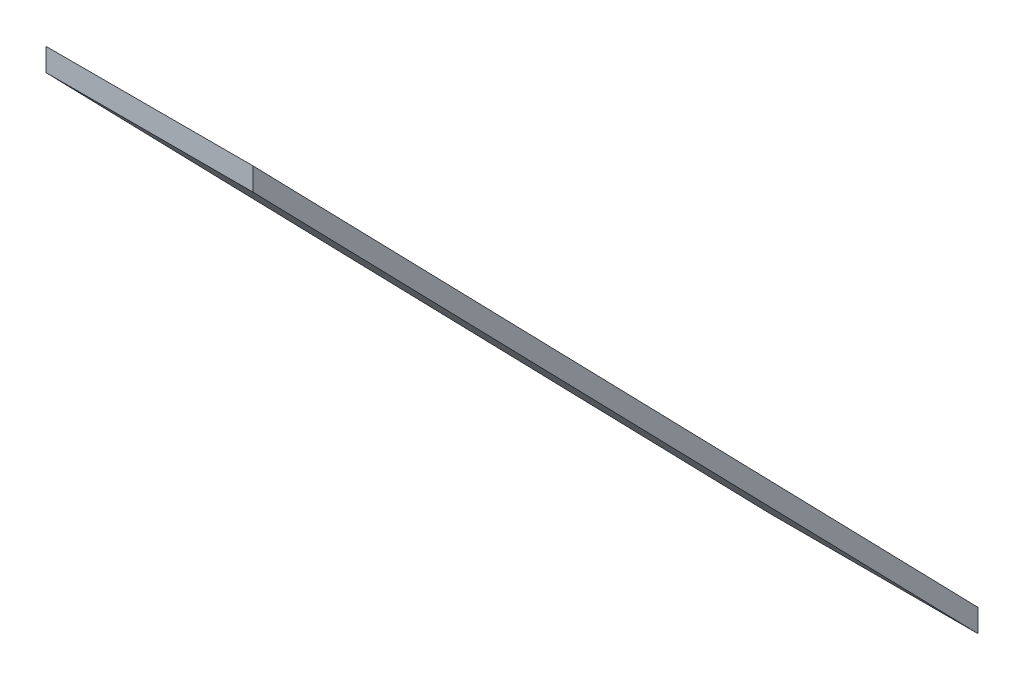
ISO-10303-21;
HEADER;
FILE_DESCRIPTION(('STEP AP214'),'2;1');
FILE_NAME('part.step','',(''),(''),'','','');
FILE_SCHEMA(('AUTOMOTIVE_DESIGN { 1 0 10303 214 1 1 1 1 }'));
ENDSEC;
DATA;
#1=APPLICATION_CONTEXT('core data for automotive mechanical design processes');
#2=APPLICATION_PROTOCOL_DEFINITION('international standard','automotive_design',2000,#1);
#3=PRODUCT_CONTEXT('',#1,'mechanical');
#4=PRODUCT('Part','Part','',(#3));
#5=PRODUCT_RELATED_PRODUCT_CATEGORY('part','',(#4));
#6=PRODUCT_DEFINITION_FORMATION('','',#4);
#7=PRODUCT_DEFINITION_CONTEXT('part definition',#1,'design');
#8=PRODUCT_DEFINITION('design','',#6,#7);
#9=PRODUCT_DEFINITION_SHAPE('','',#8);
#10=(LENGTH_UNIT() NAMED_UNIT(*) SI_UNIT(.MILLI.,.METRE.));
#11=(NAMED_UNIT(*) PLANE_ANGLE_UNIT() SI_UNIT($,.RADIAN.));
#12=(NAMED_UNIT(*) SI_UNIT($,.STERADIAN.) SOLID_ANGLE_UNIT());
#13=UNCERTAINTY_MEASURE_WITH_UNIT(LENGTH_MEASURE(1.E-05),#10,'distance_accuracy_value','');
#14=(GEOMETRIC_REPRESENTATION_CONTEXT(3) GLOBAL_UNCERTAINTY_ASSIGNED_CONTEXT((#13)) GLOBAL_UNIT_ASSIGNED_CONTEXT((#10,
#11,#12)) REPRESENTATION_CONTEXT('',''));
#15=CARTESIAN_POINT('',(0.,0.,0.));
#16=DIRECTION('',(0.,0.,1.));
#17=DIRECTION('',(1.,0.,0.));
#18=AXIS2_PLACEMENT_3D('',#15,#16,#17);
#19=CARTESIAN_POINT('',(0.,0.,3500.));
#20=DIRECTION('',(0.,0.,1.));
#21=DIRECTION('',(1.,0.,0.));
#22=AXIS2_PLACEMENT_3D('',#19,#20,#21);
#23=PLANE('',#22);
#24=DIRECTION('',(0.,1.,0.));
#25=VECTOR('',#24,1.);
#26=CARTESIAN_POINT('',(500.,3651.,3500.));
#27=LINE('',#26,#25);
#28=CARTESIAN_POINT('',(500.,3541.,3500.));
#29=VERTEX_POINT('',#28);
#30=CARTESIAN_POINT('',(500.,3651.,3500.));
#31=VERTEX_POINT('',#30);
#32=EDGE_CURVE('E80',#29,#31,#27,.T.);
#33=ORIENTED_EDGE('',*,*,#32,.T.);
#34=DIRECTION('',(-1.,0.,0.));
#35=VECTOR('',#34,1.);
#36=CARTESIAN_POINT('',(-500.,3651.,3500.));
#37=LINE('',#36,#35);
#38=CARTESIAN_POINT('',(-500.,3651.,3500.));
#39=VERTEX_POINT('',#38);
#40=EDGE_CURVE('E75',#31,#39,#37,.T.);
#41=ORIENTED_EDGE('',*,*,#40,.T.);
#42=DIRECTION('',(0.,-1.,0.));
#43=VECTOR('',#42,1.);
#44=CARTESIAN_POINT('',(-500.,3651.,3500.));
#45=LINE('',#44,#43);
#46=CARTESIAN_POINT('',(-500.,3541.,3500.));
#47=VERTEX_POINT('',#46);
#48=EDGE_CURVE('E92',#39,#47,#45,.T.);
#49=ORIENTED_EDGE('',*,*,#48,.T.);
#50=DIRECTION('',(1.,0.,0.));
#51=VECTOR('',#50,1.);
#52=CARTESIAN_POINT('',(-500.,3541.,3500.));
#53=LINE('',#52,#51);
#54=EDGE_CURVE('E85',#47,#29,#53,.T.);
#55=ORIENTED_EDGE('',*,*,#54,.T.);
#56=EDGE_LOOP('',(#33,#41,#49,#55));
#57=FACE_BOUND('',#56,.T.);
#58=ADVANCED_FACE('F39',(#57),#23,.T.);
#59=CARTESIAN_POINT('',(0.,-3596.,4.44089209850063E-13));
#60=DIRECTION('',(0.,0.,1.));
#61=DIRECTION('',(1.,0.,0.));
#62=AXIS2_PLACEMENT_3D('',#59,#60,#61);
#63=PLANE('',#62);
#64=DIRECTION('',(0.,1.,0.));
#65=VECTOR('',#64,1.);
#66=CARTESIAN_POINT('',(500.,55.0000000000002,4.44089209850063E-13));
#67=LINE('',#66,#65);
#68=CARTESIAN_POINT('',(500.,-54.9999999999999,2.22044604925031E-13));
#69=VERTEX_POINT('',#68);
#70=CARTESIAN_POINT('',(500.,54.9999999999999,2.22044604925031E-13));
#71=VERTEX_POINT('',#70);
#72=EDGE_CURVE('E54',#69,#71,#67,.T.);
#73=ORIENTED_EDGE('',*,*,#72,.F.);
#74=DIRECTION('',(1.,0.,0.));
#75=VECTOR('',#74,1.);
#76=CARTESIAN_POINT('',(-500.,-54.9999999999997,4.44089209850063E-13));
#77=LINE('',#76,#75);
#78=CARTESIAN_POINT('',(-500.,-54.9999999999999,2.22044604925031E-13));
#79=VERTEX_POINT('',#78);
#80=EDGE_CURVE('E63',#79,#69,#77,.T.);
#81=ORIENTED_EDGE('',*,*,#80,.F.);
#82=DIRECTION('',(0.,-1.,0.));
#83=VECTOR('',#82,1.);
#84=CARTESIAN_POINT('',(-500.,55.0000000000002,4.44089209850063E-13));
#85=LINE('',#84,#83);
#86=CARTESIAN_POINT('',(-500.,54.9999999999999,2.22044604925031E-13));
#87=VERTEX_POINT('',#86);
#88=EDGE_CURVE('E103',#87,#79,#85,.T.);
#89=ORIENTED_EDGE('',*,*,#88,.F.);
#90=DIRECTION('',(-1.,0.,0.));
#91=VECTOR('',#90,1.);
#92=CARTESIAN_POINT('',(-500.,55.0000000000002,4.44089209850063E-13));
#93=LINE('',#92,#91);
#94=EDGE_CURVE('E11',#71,#87,#93,.T.);
#95=ORIENTED_EDGE('',*,*,#94,.F.);
#96=EDGE_LOOP('',(#73,#81,#89,#95));
#97=FACE_BOUND('',#96,.T.);
#98=ADVANCED_FACE('F132',(#97),#63,.F.);
#99=CARTESIAN_POINT('',(-500.,3651.,3500.));
#100=DIRECTION('',(1.,0.,0.));
#101=DIRECTION('',(0.,0.,-1.));
#102=AXIS2_PLACEMENT_3D('',#99,#100,#101);
#103=PLANE('',#102);
#104=DIRECTION('',(0.,-0.716607474784545,-0.697476685691298));
#105=VECTOR('',#104,1.);
#106=CARTESIAN_POINT('',(-500.,3541.,3500.));
#107=LINE('',#106,#105);
#108=EDGE_CURVE('E95',#47,#79,#107,.T.);
#109=ORIENTED_EDGE('',*,*,#108,.F.);
#110=ORIENTED_EDGE('',*,*,#48,.F.);
#111=DIRECTION('',(0.,-0.716607474784545,-0.697476685691298));
#112=VECTOR('',#111,1.);
#113=CARTESIAN_POINT('',(-500.,3651.,3500.));
#114=LINE('',#113,#112);
#115=EDGE_CURVE('E94',#39,#87,#114,.T.);
#116=ORIENTED_EDGE('',*,*,#115,.T.);
#117=ORIENTED_EDGE('',*,*,#88,.T.);
#118=EDGE_LOOP('',(#109,#110,#116,#117));
#119=FACE_BOUND('',#118,.T.);
#120=ADVANCED_FACE('F93',(#119),#103,.F.);
#121=CARTESIAN_POINT('',(-500.,3541.,3500.));
#122=DIRECTION('',(0.,0.697476685691298,-0.716607474784545));
#123=DIRECTION('',(0.,0.716607474784545,0.697476685691298));
#124=AXIS2_PLACEMENT_3D('',#121,#122,#123);
#125=PLANE('',#124);
#126=DIRECTION('',(0.,-0.716607474784545,-0.697476685691298));
#127=VECTOR('',#126,1.);
#128=CARTESIAN_POINT('',(500.,3541.,3500.));
#129=LINE('',#128,#127);
#130=EDGE_CURVE('E113',#29,#69,#129,.T.);
#131=ORIENTED_EDGE('',*,*,#130,.F.);
#132=ORIENTED_EDGE('',*,*,#54,.F.);
#133=ORIENTED_EDGE('',*,*,#108,.T.);
#134=ORIENTED_EDGE('',*,*,#80,.T.);
#135=EDGE_LOOP('',(#131,#132,#133,#134));
#136=FACE_BOUND('',#135,.T.);
#137=ADVANCED_FACE('F123',(#136),#125,.F.);
#138=CARTESIAN_POINT('',(500.,3651.,3500.));
#139=DIRECTION('',(-1.,0.,0.));
#140=DIRECTION('',(0.,0.,1.));
#141=AXIS2_PLACEMENT_3D('',#138,#139,#140);
#142=PLANE('',#141);
#143=DIRECTION('',(0.,-0.716607474784545,-0.697476685691298));
#144=VECTOR('',#143,1.);
#145=CARTESIAN_POINT('',(500.,3651.,3500.));
#146=LINE('',#145,#144);
#147=EDGE_CURVE('E47',#31,#71,#146,.T.);
#148=ORIENTED_EDGE('',*,*,#147,.F.);
#149=ORIENTED_EDGE('',*,*,#32,.F.);
#150=ORIENTED_EDGE('',*,*,#130,.T.);
#151=ORIENTED_EDGE('',*,*,#72,.T.);
#152=EDGE_LOOP('',(#148,#149,#150,#151));
#153=FACE_BOUND('',#152,.T.);
#154=ADVANCED_FACE('F121',(#153),#142,.F.);
#155=CARTESIAN_POINT('',(-500.,3651.,3500.));
#156=DIRECTION('',(0.,-0.697476685691298,0.716607474784545));
#157=DIRECTION('',(0.,-0.716607474784545,-0.697476685691298));
#158=AXIS2_PLACEMENT_3D('',#155,#156,#157);
#159=PLANE('',#158);
#160=ORIENTED_EDGE('',*,*,#94,.T.);
#161=ORIENTED_EDGE('',*,*,#115,.F.);
#162=ORIENTED_EDGE('',*,*,#40,.F.);
#163=ORIENTED_EDGE('',*,*,#147,.T.);
#164=EDGE_LOOP('',(#160,#161,#162,#163));
#165=FACE_BOUND('',#164,.T.);
#166=ADVANCED_FACE('F100',(#165),#159,.F.);
#167=CLOSED_SHELL('',(#58,#98,#120,#137,#154,#166));
#168=MANIFOLD_SOLID_BREP('B2',#167);
#169=ADVANCED_BREP_SHAPE_REPRESENTATION('',(#18,#168),#14);
#170=SHAPE_DEFINITION_REPRESENTATION(#9,#169);
ENDSEC;
END-ISO-10303-21;
